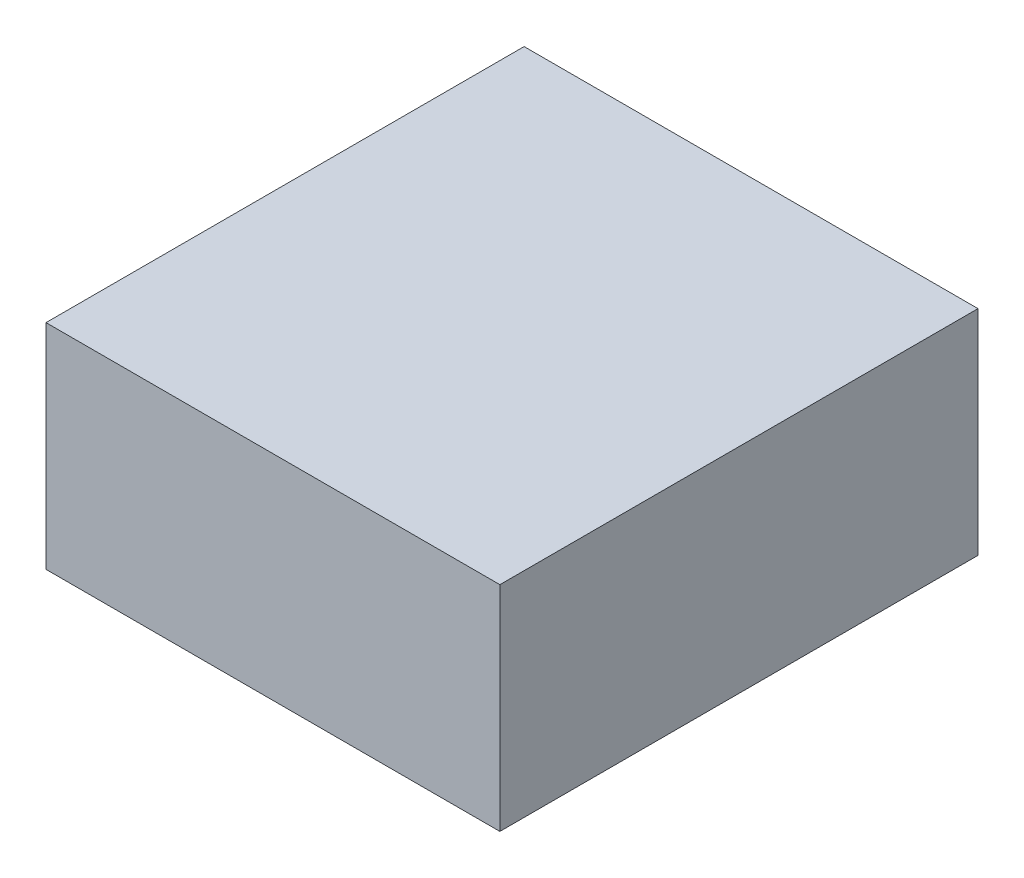
ISO-10303-21;
HEADER;
FILE_DESCRIPTION(('STEP AP214'),'2;1');
FILE_NAME('part.step','',(''),(''),'','','');
FILE_SCHEMA(('AUTOMOTIVE_DESIGN { 1 0 10303 214 1 1 1 1 }'));
ENDSEC;
DATA;
#1=APPLICATION_CONTEXT('core data for automotive mechanical design processes');
#2=APPLICATION_PROTOCOL_DEFINITION('international standard','automotive_design',2000,#1);
#3=PRODUCT_CONTEXT('',#1,'mechanical');
#4=PRODUCT('Part','Part','',(#3));
#5=PRODUCT_RELATED_PRODUCT_CATEGORY('part','',(#4));
#6=PRODUCT_DEFINITION_FORMATION('','',#4);
#7=PRODUCT_DEFINITION_CONTEXT('part definition',#1,'design');
#8=PRODUCT_DEFINITION('design','',#6,#7);
#9=PRODUCT_DEFINITION_SHAPE('','',#8);
#10=(LENGTH_UNIT() NAMED_UNIT(*) SI_UNIT(.MILLI.,.METRE.));
#11=(NAMED_UNIT(*) PLANE_ANGLE_UNIT() SI_UNIT($,.RADIAN.));
#12=(NAMED_UNIT(*) SI_UNIT($,.STERADIAN.) SOLID_ANGLE_UNIT());
#13=UNCERTAINTY_MEASURE_WITH_UNIT(LENGTH_MEASURE(1.E-05),#10,'distance_accuracy_value','');
#14=(GEOMETRIC_REPRESENTATION_CONTEXT(3) GLOBAL_UNCERTAINTY_ASSIGNED_CONTEXT((#13)) GLOBAL_UNIT_ASSIGNED_CONTEXT((#10,
#11,#12)) REPRESENTATION_CONTEXT('',''));
#15=CARTESIAN_POINT('',(0.,0.,0.));
#16=DIRECTION('',(0.,0.,1.));
#17=DIRECTION('',(1.,0.,0.));
#18=AXIS2_PLACEMENT_3D('',#15,#16,#17);
#19=CARTESIAN_POINT('',(-5.14999986,-2.42499896,10.85000116));
#20=DIRECTION('',(0.,0.,-1.));
#21=DIRECTION('',(0.,-1.,0.));
#22=AXIS2_PLACEMENT_3D('',#19,#20,#21);
#23=PLANE('',#22);
#24=DIRECTION('',(1.,0.,0.));
#25=VECTOR('',#24,1.);
#26=CARTESIAN_POINT('',(-5.14999986,-2.42499896,10.85000116));
#27=LINE('',#26,#25);
#28=CARTESIAN_POINT('',(-5.14999986,-2.42499896,10.85000116));
#29=VERTEX_POINT('',#28);
#30=CARTESIAN_POINT('',(5.14999986,-2.42499896,10.85000116));
#31=VERTEX_POINT('',#30);
#32=EDGE_CURVE('E88',#29,#31,#27,.T.);
#33=ORIENTED_EDGE('',*,*,#32,.T.);
#34=DIRECTION('',(0.,1.,0.));
#35=VECTOR('',#34,1.);
#36=CARTESIAN_POINT('',(5.14999986,-2.42499896,10.85000116));
#37=LINE('',#36,#35);
#38=CARTESIAN_POINT('',(5.14999986,2.4250015,10.85000116));
#39=VERTEX_POINT('',#38);
#40=EDGE_CURVE('E78',#31,#39,#37,.T.);
#41=ORIENTED_EDGE('',*,*,#40,.T.);
#42=DIRECTION('',(-1.,0.,0.));
#43=VECTOR('',#42,1.);
#44=CARTESIAN_POINT('',(5.14999986,2.4250015,10.85000116));
#45=LINE('',#44,#43);
#46=CARTESIAN_POINT('',(-5.14999986,2.4250015,10.85000116));
#47=VERTEX_POINT('',#46);
#48=EDGE_CURVE('E21',#39,#47,#45,.T.);
#49=ORIENTED_EDGE('',*,*,#48,.T.);
#50=DIRECTION('',(0.,-1.,0.));
#51=VECTOR('',#50,1.);
#52=CARTESIAN_POINT('',(-5.14999986,2.4250015,10.85000116));
#53=LINE('',#52,#51);
#54=EDGE_CURVE('E11',#47,#29,#53,.T.);
#55=ORIENTED_EDGE('',*,*,#54,.T.);
#56=EDGE_LOOP('',(#33,#41,#49,#55));
#57=FACE_BOUND('',#56,.T.);
#58=ADVANCED_FACE('F17',(#57),#23,.F.);
#59=CARTESIAN_POINT('',(-5.14999986,-2.42499896,0.));
#60=DIRECTION('',(0.,0.,-1.));
#61=DIRECTION('',(0.,-1.,0.));
#62=AXIS2_PLACEMENT_3D('',#59,#60,#61);
#63=PLANE('',#62);
#64=DIRECTION('',(0.,-1.,0.));
#65=VECTOR('',#64,1.);
#66=CARTESIAN_POINT('',(-5.14999986,2.4250015,0.));
#67=LINE('',#66,#65);
#68=CARTESIAN_POINT('',(-5.14999986,2.4250015,0.));
#69=VERTEX_POINT('',#68);
#70=CARTESIAN_POINT('',(-5.14999986,-2.42499896,0.));
#71=VERTEX_POINT('',#70);
#72=EDGE_CURVE('E28',#69,#71,#67,.T.);
#73=ORIENTED_EDGE('',*,*,#72,.F.);
#74=DIRECTION('',(-1.,0.,0.));
#75=VECTOR('',#74,1.);
#76=CARTESIAN_POINT('',(5.14999986,2.4250015,0.));
#77=LINE('',#76,#75);
#78=CARTESIAN_POINT('',(5.14999986,2.4250015,0.));
#79=VERTEX_POINT('',#78);
#80=EDGE_CURVE('E65',#79,#69,#77,.T.);
#81=ORIENTED_EDGE('',*,*,#80,.F.);
#82=DIRECTION('',(0.,1.,0.));
#83=VECTOR('',#82,1.);
#84=CARTESIAN_POINT('',(5.14999986,-2.42499896,0.));
#85=LINE('',#84,#83);
#86=CARTESIAN_POINT('',(5.14999986,-2.42499896,0.));
#87=VERTEX_POINT('',#86);
#88=EDGE_CURVE('E114',#87,#79,#85,.T.);
#89=ORIENTED_EDGE('',*,*,#88,.F.);
#90=DIRECTION('',(1.,0.,0.));
#91=VECTOR('',#90,1.);
#92=CARTESIAN_POINT('',(-5.14999986,-2.42499896,0.));
#93=LINE('',#92,#91);
#94=EDGE_CURVE('E96',#71,#87,#93,.T.);
#95=ORIENTED_EDGE('',*,*,#94,.F.);
#96=EDGE_LOOP('',(#73,#81,#89,#95));
#97=FACE_BOUND('',#96,.T.);
#98=ADVANCED_FACE('F169',(#97),#63,.T.);
#99=CARTESIAN_POINT('',(-5.14999986,2.4250015,0.));
#100=DIRECTION('',(1.,0.,0.));
#101=DIRECTION('',(0.,1.,0.));
#102=AXIS2_PLACEMENT_3D('',#99,#100,#101);
#103=PLANE('',#102);
#104=ORIENTED_EDGE('',*,*,#72,.T.);
#105=DIRECTION('',(0.,0.,1.));
#106=VECTOR('',#105,1.);
#107=CARTESIAN_POINT('',(-5.14999986,-2.42499896,0.));
#108=LINE('',#107,#106);
#109=EDGE_CURVE('E92',#71,#29,#108,.T.);
#110=ORIENTED_EDGE('',*,*,#109,.T.);
#111=ORIENTED_EDGE('',*,*,#54,.F.);
#112=DIRECTION('',(0.,0.,1.));
#113=VECTOR('',#112,1.);
#114=CARTESIAN_POINT('',(-5.14999986,2.4250015,0.));
#115=LINE('',#114,#113);
#116=EDGE_CURVE('E106',#69,#47,#115,.T.);
#117=ORIENTED_EDGE('',*,*,#116,.F.);
#118=EDGE_LOOP('',(#104,#110,#111,#117));
#119=FACE_BOUND('',#118,.T.);
#120=ADVANCED_FACE('F184',(#119),#103,.F.);
#121=CARTESIAN_POINT('',(5.14999986,2.4250015,0.));
#122=DIRECTION('',(0.,-1.,0.));
#123=DIRECTION('',(0.,0.,-1.));
#124=AXIS2_PLACEMENT_3D('',#121,#122,#123);
#125=PLANE('',#124);
#126=ORIENTED_EDGE('',*,*,#80,.T.);
#127=ORIENTED_EDGE('',*,*,#116,.T.);
#128=ORIENTED_EDGE('',*,*,#48,.F.);
#129=DIRECTION('',(0.,0.,1.));
#130=VECTOR('',#129,1.);
#131=CARTESIAN_POINT('',(5.14999986,2.4250015,0.));
#132=LINE('',#131,#130);
#133=EDGE_CURVE('E84',#79,#39,#132,.T.);
#134=ORIENTED_EDGE('',*,*,#133,.F.);
#135=EDGE_LOOP('',(#126,#127,#128,#134));
#136=FACE_BOUND('',#135,.T.);
#137=ADVANCED_FACE('F19',(#136),#125,.F.);
#138=CARTESIAN_POINT('',(5.14999986,-2.42499896,0.));
#139=DIRECTION('',(-1.,0.,0.));
#140=DIRECTION('',(0.,0.,1.));
#141=AXIS2_PLACEMENT_3D('',#138,#139,#140);
#142=PLANE('',#141);
#143=ORIENTED_EDGE('',*,*,#88,.T.);
#144=ORIENTED_EDGE('',*,*,#133,.T.);
#145=ORIENTED_EDGE('',*,*,#40,.F.);
#146=DIRECTION('',(0.,0.,1.));
#147=VECTOR('',#146,1.);
#148=CARTESIAN_POINT('',(5.14999986,-2.42499896,0.));
#149=LINE('',#148,#147);
#150=EDGE_CURVE('E82',#87,#31,#149,.T.);
#151=ORIENTED_EDGE('',*,*,#150,.F.);
#152=EDGE_LOOP('',(#143,#144,#145,#151));
#153=FACE_BOUND('',#152,.T.);
#154=ADVANCED_FACE('F80',(#153),#142,.F.);
#155=CARTESIAN_POINT('',(-5.14999986,-2.42499896,0.));
#156=DIRECTION('',(0.,1.,0.));
#157=DIRECTION('',(1.,0.,0.));
#158=AXIS2_PLACEMENT_3D('',#155,#156,#157);
#159=PLANE('',#158);
#160=ORIENTED_EDGE('',*,*,#94,.T.);
#161=ORIENTED_EDGE('',*,*,#150,.T.);
#162=ORIENTED_EDGE('',*,*,#32,.F.);
#163=ORIENTED_EDGE('',*,*,#109,.F.);
#164=EDGE_LOOP('',(#160,#161,#162,#163));
#165=FACE_BOUND('',#164,.T.);
#166=ADVANCED_FACE('F94',(#165),#159,.F.);
#167=CLOSED_SHELL('',(#58,#98,#120,#137,#154,#166));
#168=MANIFOLD_SOLID_BREP('B1',#167);
#169=ADVANCED_BREP_SHAPE_REPRESENTATION('',(#18,#168),#14);
#170=SHAPE_DEFINITION_REPRESENTATION(#9,#169);
ENDSEC;
END-ISO-10303-21;
